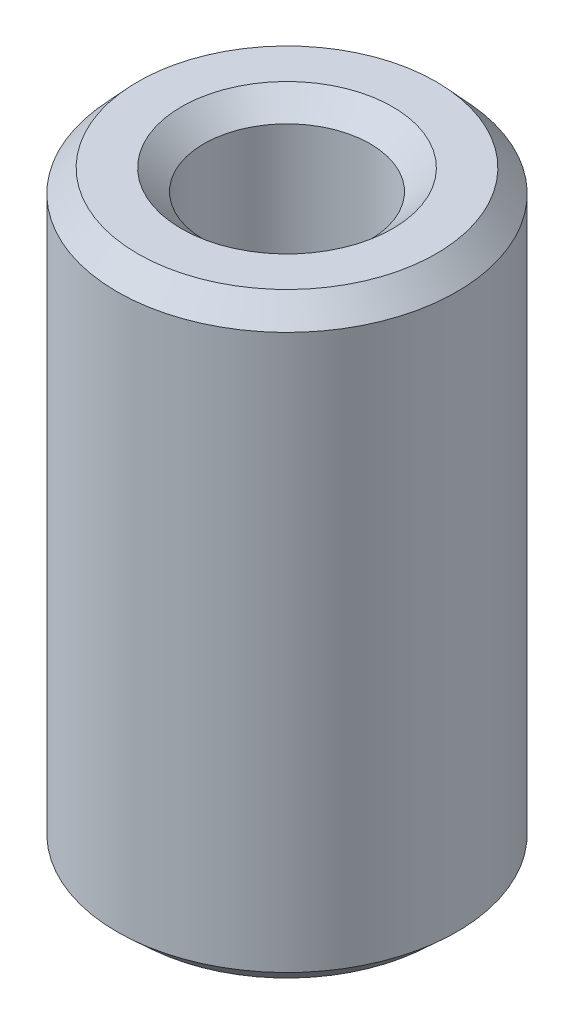
ISO-10303-21;
HEADER;
FILE_DESCRIPTION(('STEP AP214'),'2;1');
FILE_NAME('part.step','',(''),(''),'','','');
FILE_SCHEMA(('AUTOMOTIVE_DESIGN { 1 0 10303 214 1 1 1 1 }'));
ENDSEC;
DATA;
#1=APPLICATION_CONTEXT('core data for automotive mechanical design processes');
#2=APPLICATION_PROTOCOL_DEFINITION('international standard','automotive_design',2000,#1);
#3=PRODUCT_CONTEXT('',#1,'mechanical');
#4=PRODUCT('Part','Part','',(#3));
#5=PRODUCT_RELATED_PRODUCT_CATEGORY('part','',(#4));
#6=PRODUCT_DEFINITION_FORMATION('','',#4);
#7=PRODUCT_DEFINITION_CONTEXT('part definition',#1,'design');
#8=PRODUCT_DEFINITION('design','',#6,#7);
#9=PRODUCT_DEFINITION_SHAPE('','',#8);
#10=(LENGTH_UNIT() NAMED_UNIT(*) SI_UNIT(.MILLI.,.METRE.));
#11=(NAMED_UNIT(*) PLANE_ANGLE_UNIT() SI_UNIT($,.RADIAN.));
#12=(NAMED_UNIT(*) SI_UNIT($,.STERADIAN.) SOLID_ANGLE_UNIT());
#13=UNCERTAINTY_MEASURE_WITH_UNIT(LENGTH_MEASURE(1.E-05),#10,'distance_accuracy_value','');
#14=(GEOMETRIC_REPRESENTATION_CONTEXT(3) GLOBAL_UNCERTAINTY_ASSIGNED_CONTEXT((#13)) GLOBAL_UNIT_ASSIGNED_CONTEXT((#10,
#11,#12)) REPRESENTATION_CONTEXT('',''));
#15=CARTESIAN_POINT('',(0.,0.,0.));
#16=DIRECTION('',(0.,0.,1.));
#17=DIRECTION('',(1.,0.,0.));
#18=AXIS2_PLACEMENT_3D('',#15,#16,#17);
#19=CARTESIAN_POINT('',(0.,52.7762804716084,0.));
#20=DIRECTION('',(0.,-1.,0.));
#21=DIRECTION('',(0.,0.,-1.));
#22=AXIS2_PLACEMENT_3D('',#19,#20,#21);
#23=CYLINDRICAL_SURFACE('',#22,15.);
#24=CARTESIAN_POINT('',(0.,1.82945939377958,0.));
#25=DIRECTION('',(0.,1.,0.));
#26=DIRECTION('',(0.,0.,1.));
#27=AXIS2_PLACEMENT_3D('',#24,#25,#26);
#28=CIRCLE('',#27,15.);
#29=CARTESIAN_POINT('',(0.,1.82945939377957,-15.));
#30=VERTEX_POINT('',#29);
#31=EDGE_CURVE('E10',#30,#30,#28,.T.);
#32=CARTESIAN_POINT('',(0.,50.7862467697742,0.));
#33=DIRECTION('',(0.,1.,0.));
#34=DIRECTION('',(0.,0.,1.));
#35=AXIS2_PLACEMENT_3D('',#32,#33,#34);
#36=CIRCLE('',#35,15.);
#37=CARTESIAN_POINT('',(0.,50.7862467697742,-15.));
#38=VERTEX_POINT('',#37);
#39=EDGE_CURVE('E50',#38,#38,#36,.F.);
#40=CARTESIAN_POINT('',(0.,1.82945939377957,-15.));
#41=CARTESIAN_POINT('',(0.,2.33942592894618,-15.));
#42=CARTESIAN_POINT('',(0.,2.84939246411279,-15.));
#43=CARTESIAN_POINT('',(0.,3.86932553444601,-15.));
#44=CARTESIAN_POINT('',(0.,4.37929206961262,-15.));
#45=CARTESIAN_POINT('',(0.,5.39922513994584,-15.));
#46=CARTESIAN_POINT('',(0.,5.90919167511246,-15.));
#47=CARTESIAN_POINT('',(0.,6.92912474544568,-15.));
#48=CARTESIAN_POINT('',(0.,7.43909128061229,-15.));
#49=CARTESIAN_POINT('',(0.,8.45902435094551,-15.));
#50=CARTESIAN_POINT('',(0.,8.96899088611212,-15.));
#51=CARTESIAN_POINT('',(0.,9.98892395644534,-15.));
#52=CARTESIAN_POINT('',(0.,10.498890491612,-15.));
#53=CARTESIAN_POINT('',(0.,11.5188235619452,-15.));
#54=CARTESIAN_POINT('',(0.,12.0287900971118,-15.));
#55=CARTESIAN_POINT('',(0.,13.048723167445,-15.));
#56=CARTESIAN_POINT('',(0.,13.5586897026116,-15.));
#57=CARTESIAN_POINT('',(0.,14.5786227729448,-15.));
#58=CARTESIAN_POINT('',(0.,15.0885893081114,-15.));
#59=CARTESIAN_POINT('',(0.,16.1085223784447,-15.));
#60=CARTESIAN_POINT('',(0.,16.6184889136113,-15.));
#61=CARTESIAN_POINT('',(0.,17.6384219839445,-15.));
#62=CARTESIAN_POINT('',(0.,18.1483885191111,-15.));
#63=CARTESIAN_POINT('',(0.,19.1683215894443,-15.));
#64=CARTESIAN_POINT('',(0.,19.6782881246109,-15.));
#65=CARTESIAN_POINT('',(0.,20.6982211949442,-15.));
#66=CARTESIAN_POINT('',(0.,21.2081877301108,-15.));
#67=CARTESIAN_POINT('',(0.,22.228120800444,-15.));
#68=CARTESIAN_POINT('',(0.,22.7380873356106,-15.));
#69=CARTESIAN_POINT('',(0.,23.7580204059438,-15.));
#70=CARTESIAN_POINT('',(0.,24.2679869411104,-15.));
#71=CARTESIAN_POINT('',(0.,25.2879200114437,-15.));
#72=CARTESIAN_POINT('',(0.,25.7978865466103,-15.));
#73=CARTESIAN_POINT('',(0.,26.8178196169435,-15.));
#74=CARTESIAN_POINT('',(0.,27.3277861521101,-15.));
#75=CARTESIAN_POINT('',(0.,28.3477192224433,-15.));
#76=CARTESIAN_POINT('',(0.,28.8576857576099,-15.));
#77=CARTESIAN_POINT('',(0.,29.8776188279432,-15.));
#78=CARTESIAN_POINT('',(0.,30.3875853631098,-15.));
#79=CARTESIAN_POINT('',(0.,31.407518433443,-15.));
#80=CARTESIAN_POINT('',(0.,31.9174849686096,-15.));
#81=CARTESIAN_POINT('',(0.,32.9374180389428,-15.));
#82=CARTESIAN_POINT('',(0.,33.4473845741094,-15.));
#83=CARTESIAN_POINT('',(0.,34.4673176444427,-15.));
#84=CARTESIAN_POINT('',(0.,34.9772841796093,-15.));
#85=CARTESIAN_POINT('',(0.,35.9972172499425,-15.));
#86=CARTESIAN_POINT('',(0.,36.5071837851091,-15.));
#87=CARTESIAN_POINT('',(0.,37.5271168554423,-15.));
#88=CARTESIAN_POINT('',(0.,38.0370833906089,-15.));
#89=CARTESIAN_POINT('',(0.,39.0570164609421,-15.));
#90=CARTESIAN_POINT('',(0.,39.5669829961087,-15.));
#91=CARTESIAN_POINT('',(0.,40.586916066442,-15.));
#92=CARTESIAN_POINT('',(0.,41.0968826016086,-15.));
#93=CARTESIAN_POINT('',(0.,42.1168156719418,-15.));
#94=CARTESIAN_POINT('',(0.,42.6267822071084,-15.));
#95=CARTESIAN_POINT('',(0.,43.6467152774416,-15.));
#96=CARTESIAN_POINT('',(0.,44.1566818126082,-15.));
#97=CARTESIAN_POINT('',(0.,45.1766148829415,-15.));
#98=CARTESIAN_POINT('',(0.,45.6865814181081,-15.));
#99=CARTESIAN_POINT('',(0.,46.7065144884413,-15.));
#100=CARTESIAN_POINT('',(0.,47.2164810236079,-15.));
#101=CARTESIAN_POINT('',(0.,48.2364140939411,-15.));
#102=CARTESIAN_POINT('',(0.,48.7463806291077,-15.));
#103=CARTESIAN_POINT('',(0.,49.766313699441,-15.));
#104=CARTESIAN_POINT('',(0.,50.2762802346076,-15.));
#105=CARTESIAN_POINT('',(0.,50.7862467697742,-15.));
#106=B_SPLINE_CURVE_WITH_KNOTS('',3,(#40,#41,#42,#43,#44,#45,#46,#47,#48,#49,#50,#51,#52,#53,
#54,#55,#56,#57,#58,#59,#60,#61,#62,#63,#64,#65,#66,#67,#68,#69,#70,#71,#72,#73,#74,#75,#76,#77,
#78,#79,#80,#81,#82,#83,#84,#85,#86,#87,#88,#89,#90,#91,#92,#93,#94,#95,#96,#97,#98,#99,#100,
#101,#102,#103,#104,#105),.UNSPECIFIED.,.F.,.F.,(4,2,2,2,2,2,2,2,2,2,2,2,2,2,2,2,2,2,2,2,2,2,2,
2,2,2,2,2,2,2,2,2,4),(0.,1.52989960549983,3.05979921099966,4.5896988164995,6.11959842199933,
7.64949802749916,9.17939763299899,10.7092972384988,12.2391968439987,13.7690964494985,
15.2989960549983,16.8288956604982,18.358795265998,19.8886948714978,21.4185944769976,
22.9484940824975,24.4783936879973,26.0082932934971,27.538192898997,29.0680925044968,
30.5979921099966,32.1278917154965,33.6577913209963,35.1876909264961,36.717590531996,
38.2474901374958,39.7773897429956,41.3072893484955,42.8371889539953,44.3670885594951,
45.896988164995,47.4268877704948,48.9567873759946),.UNSPECIFIED.);
#107=EDGE_CURVE('BSEAM39',#30,#38,#106,.T.);
#108=ORIENTED_EDGE('',*,*,#31,.T.);
#109=ORIENTED_EDGE('',*,*,#39,.T.);
#110=ORIENTED_EDGE('',*,*,#107,.T.);
#111=ORIENTED_EDGE('',*,*,#107,.F.);
#112=EDGE_LOOP('',(#108,#110,#109,#111));
#113=FACE_BOUND('',#112,.T.);
#114=ADVANCED_FACE('F39',(#113),#23,.T.);
#115=CARTESIAN_POINT('',(0.,52.7762804716084,0.));
#116=DIRECTION('',(0.,1.,0.));
#117=DIRECTION('',(0.,0.,1.));
#118=AXIS2_PLACEMENT_3D('',#115,#116,#117);
#119=PLANE('',#118);
#120=CARTESIAN_POINT('',(0.,52.7762804716084,0.));
#121=DIRECTION('',(0.,1.,0.));
#122=DIRECTION('',(0.,0.,1.));
#123=AXIS2_PLACEMENT_3D('',#120,#121,#122);
#124=CIRCLE('',#123,9.32959776285785);
#125=CARTESIAN_POINT('',(0.,52.7762804716084,9.32959776285785));
#126=VERTEX_POINT('',#125);
#127=EDGE_CURVE('E58',#126,#126,#124,.F.);
#128=ORIENTED_EDGE('',*,*,#127,.T.);
#129=EDGE_LOOP('',(#128));
#130=FACE_BOUND('',#129,.T.);
#131=CARTESIAN_POINT('',(0.,52.7762804716084,0.));
#132=DIRECTION('',(0.,1.,0.));
#133=DIRECTION('',(0.,0.,1.));
#134=AXIS2_PLACEMENT_3D('',#131,#132,#133);
#135=CIRCLE('',#134,13.1705406062205);
#136=CARTESIAN_POINT('',(0.,52.7762804716084,13.1705406062205));
#137=VERTEX_POINT('',#136);
#138=EDGE_CURVE('E61',#137,#137,#135,.T.);
#139=ORIENTED_EDGE('',*,*,#138,.T.);
#140=EDGE_LOOP('',(#139));
#141=FACE_BOUND('',#140,.T.);
#142=ADVANCED_FACE('F88',(#130,#141),#119,.T.);
#143=CARTESIAN_POINT('',(0.,0.,0.));
#144=DIRECTION('',(0.,1.,0.));
#145=DIRECTION('',(0.,0.,1.));
#146=AXIS2_PLACEMENT_3D('',#143,#144,#145);
#147=PLANE('',#146);
#148=CARTESIAN_POINT('',(0.,0.,0.));
#149=DIRECTION('',(0.,1.,0.));
#150=DIRECTION('',(0.,0.,1.));
#151=AXIS2_PLACEMENT_3D('',#148,#149,#150);
#152=CIRCLE('',#151,9.16902345480308);
#153=CARTESIAN_POINT('',(0.,0.,9.16902345480308));
#154=VERTEX_POINT('',#153);
#155=EDGE_CURVE('E51',#154,#154,#152,.T.);
#156=ORIENTED_EDGE('',*,*,#155,.T.);
#157=EDGE_LOOP('',(#156));
#158=FACE_BOUND('',#157,.T.);
#159=CARTESIAN_POINT('',(0.,0.,0.));
#160=DIRECTION('',(0.,1.,0.));
#161=DIRECTION('',(0.,0.,1.));
#162=AXIS2_PLACEMENT_3D('',#159,#160,#161);
#163=CIRCLE('',#162,13.0099662981657);
#164=CARTESIAN_POINT('',(0.,0.,13.0099662981657));
#165=VERTEX_POINT('',#164);
#166=EDGE_CURVE('E54',#165,#165,#163,.F.);
#167=ORIENTED_EDGE('',*,*,#166,.T.);
#168=EDGE_LOOP('',(#167));
#169=FACE_BOUND('',#168,.T.);
#170=ADVANCED_FACE('F83',(#158,#169),#147,.F.);
#171=CARTESIAN_POINT('',(0.,52.7762804716084,0.));
#172=DIRECTION('',(0.,-1.,0.));
#173=DIRECTION('',(0.,0.,-1.));
#174=AXIS2_PLACEMENT_3D('',#171,#172,#173);
#175=CYLINDRICAL_SURFACE('',#174,7.33956406102357);
#176=CARTESIAN_POINT('',(0.,50.9468210778288,0.));
#177=DIRECTION('',(0.,1.,0.));
#178=DIRECTION('',(0.,0.,1.));
#179=AXIS2_PLACEMENT_3D('',#176,#177,#178);
#180=CIRCLE('',#179,7.33956406102357);
#181=CARTESIAN_POINT('',(0.,50.9468210778288,-7.33956406102357));
#182=VERTEX_POINT('',#181);
#183=EDGE_CURVE('E67',#182,#182,#180,.T.);
#184=CARTESIAN_POINT('',(0.,1.99003370183423,0.));
#185=DIRECTION('',(0.,1.,0.));
#186=DIRECTION('',(0.,0.,1.));
#187=AXIS2_PLACEMENT_3D('',#184,#185,#186);
#188=CIRCLE('',#187,7.33956406102357);
#189=CARTESIAN_POINT('',(0.,1.99003370183423,-7.33956406102357));
#190=VERTEX_POINT('',#189);
#191=EDGE_CURVE('E69',#190,#190,#188,.F.);
#192=CARTESIAN_POINT('',(0.,50.9468210778288,-7.33956406102357));
#193=CARTESIAN_POINT('',(0.,50.4368545426622,-7.33956406102357));
#194=CARTESIAN_POINT('',(0.,49.9268880074956,-7.33956406102357));
#195=CARTESIAN_POINT('',(0.,48.9069549371624,-7.33956406102357));
#196=CARTESIAN_POINT('',(0.,48.3969884019958,-7.33956406102357));
#197=CARTESIAN_POINT('',(0.,47.3770553316625,-7.33956406102357));
#198=CARTESIAN_POINT('',(0.,46.8670887964959,-7.33956406102357));
#199=CARTESIAN_POINT('',(0.,45.8471557261627,-7.33956406102357));
#200=CARTESIAN_POINT('',(0.,45.3371891909961,-7.33956406102357));
#201=CARTESIAN_POINT('',(0.,44.3172561206629,-7.33956406102357));
#202=CARTESIAN_POINT('',(0.,43.8072895854963,-7.33956406102357));
#203=CARTESIAN_POINT('',(0.,42.787356515163,-7.33956406102357));
#204=CARTESIAN_POINT('',(0.,42.2773899799964,-7.33956406102357));
#205=CARTESIAN_POINT('',(0.,41.2574569096632,-7.33956406102357));
#206=CARTESIAN_POINT('',(0.,40.7474903744966,-7.33956406102357));
#207=CARTESIAN_POINT('',(0.,39.7275573041634,-7.33956406102357));
#208=CARTESIAN_POINT('',(0.,39.2175907689968,-7.33956406102357));
#209=CARTESIAN_POINT('',(0.,38.1976576986635,-7.33956406102357));
#210=CARTESIAN_POINT('',(0.,37.6876911634969,-7.33956406102357));
#211=CARTESIAN_POINT('',(0.,36.6677580931637,-7.33956406102357));
#212=CARTESIAN_POINT('',(0.,36.1577915579971,-7.33956406102357));
#213=CARTESIAN_POINT('',(0.,35.1378584876639,-7.33956406102357));
#214=CARTESIAN_POINT('',(0.,34.6278919524973,-7.33956406102357));
#215=CARTESIAN_POINT('',(0.,33.6079588821641,-7.33956406102357));
#216=CARTESIAN_POINT('',(0.,33.0979923469975,-7.33956406102357));
#217=CARTESIAN_POINT('',(0.,32.0780592766642,-7.33956406102357));
#218=CARTESIAN_POINT('',(0.,31.5680927414976,-7.33956406102357));
#219=CARTESIAN_POINT('',(0.,30.5481596711644,-7.33956406102357));
#220=CARTESIAN_POINT('',(0.,30.0381931359978,-7.33956406102357));
#221=CARTESIAN_POINT('',(0.,29.0182600656646,-7.33956406102357));
#222=CARTESIAN_POINT('',(0.,28.508293530498,-7.33956406102357));
#223=CARTESIAN_POINT('',(0.,27.4883604601647,-7.33956406102357));
#224=CARTESIAN_POINT('',(0.,26.9783939249981,-7.33956406102357));
#225=CARTESIAN_POINT('',(0.,25.9584608546649,-7.33956406102357));
#226=CARTESIAN_POINT('',(0.,25.4484943194983,-7.33956406102357));
#227=CARTESIAN_POINT('',(0.,24.4285612491651,-7.33956406102357));
#228=CARTESIAN_POINT('',(0.,23.9185947139985,-7.33956406102357));
#229=CARTESIAN_POINT('',(0.,22.8986616436652,-7.33956406102357));
#230=CARTESIAN_POINT('',(0.,22.3886951084986,-7.33956406102357));
#231=CARTESIAN_POINT('',(0.,21.3687620381654,-7.33956406102357));
#232=CARTESIAN_POINT('',(0.,20.8587955029988,-7.33956406102357));
#233=CARTESIAN_POINT('',(0.,19.8388624326656,-7.33956406102357));
#234=CARTESIAN_POINT('',(0.,19.328895897499,-7.33956406102357));
#235=CARTESIAN_POINT('',(0.,18.3089628271658,-7.33956406102357));
#236=CARTESIAN_POINT('',(0.,17.7989962919991,-7.33956406102357));
#237=CARTESIAN_POINT('',(0.,16.7790632216659,-7.33956406102357));
#238=CARTESIAN_POINT('',(0.,16.2690966864993,-7.33956406102357));
#239=CARTESIAN_POINT('',(0.,15.2491636161661,-7.33956406102357));
#240=CARTESIAN_POINT('',(0.,14.7391970809995,-7.33956406102357));
#241=CARTESIAN_POINT('',(0.,13.7192640106663,-7.33956406102357));
#242=CARTESIAN_POINT('',(0.,13.2092974754997,-7.33956406102357));
#243=CARTESIAN_POINT('',(0.,12.1893644051664,-7.33956406102357));
#244=CARTESIAN_POINT('',(0.,11.6793978699998,-7.33956406102357));
#245=CARTESIAN_POINT('',(0.,10.6594647996666,-7.33956406102357));
#246=CARTESIAN_POINT('',(0.,10.1494982645,-7.33956406102357));
#247=CARTESIAN_POINT('',(0.,9.12956519416677,-7.33956406102357));
#248=CARTESIAN_POINT('',(0.,8.61959865900016,-7.33956406102357));
#249=CARTESIAN_POINT('',(0.,7.59966558866694,-7.33956406102357));
#250=CARTESIAN_POINT('',(0.,7.08969905350032,-7.33956406102357));
#251=CARTESIAN_POINT('',(0.,6.06976598316711,-7.33956406102357));
#252=CARTESIAN_POINT('',(0.,5.5597994480005,-7.33956406102357));
#253=CARTESIAN_POINT('',(0.,4.53986637766729,-7.33956406102357));
#254=CARTESIAN_POINT('',(0.,4.02989984250067,-7.33956406102357));
#255=CARTESIAN_POINT('',(0.,3.00996677216745,-7.33956406102357));
#256=CARTESIAN_POINT('',(0.,2.50000023700084,-7.33956406102357));
#257=CARTESIAN_POINT('',(0.,1.99003370183423,-7.33956406102357));
#258=B_SPLINE_CURVE_WITH_KNOTS('',3,(#192,#193,#194,#195,#196,#197,#198,#199,#200,#201,#202,
#203,#204,#205,#206,#207,#208,#209,#210,#211,#212,#213,#214,#215,#216,#217,#218,#219,#220,#221,
#222,#223,#224,#225,#226,#227,#228,#229,#230,#231,#232,#233,#234,#235,#236,#237,#238,#239,#240,
#241,#242,#243,#244,#245,#246,#247,#248,#249,#250,#251,#252,#253,#254,#255,#256,#257),
.UNSPECIFIED.,.F.,.F.,(4,2,2,2,2,2,2,2,2,2,2,2,2,2,2,2,2,2,2,2,2,2,2,2,2,2,2,2,2,2,2,2,4),(0.,
1.52989960549983,3.05979921099966,4.5896988164995,6.11959842199932,7.64949802749915,
9.17939763299898,10.7092972384988,12.2391968439987,13.7690964494985,15.2989960549983,
16.8288956604981,18.358795265998,19.8886948714978,21.4185944769976,22.9484940824975,
24.4783936879973,26.0082932934971,27.538192898997,29.0680925044968,30.5979921099966,
32.1278917154964,33.6577913209963,35.1876909264961,36.7175905319959,38.2474901374958,
39.7773897429956,41.3072893484954,42.8371889539953,44.3670885594951,45.8969881649949,
47.4268877704947,48.9567873759946),.UNSPECIFIED.);
#259=EDGE_CURVE('BSEAM71',#182,#190,#258,.T.);
#260=ORIENTED_EDGE('',*,*,#183,.T.);
#261=ORIENTED_EDGE('',*,*,#191,.T.);
#262=ORIENTED_EDGE('',*,*,#259,.T.);
#263=ORIENTED_EDGE('',*,*,#259,.F.);
#264=EDGE_LOOP('',(#260,#262,#261,#263));
#265=FACE_BOUND('',#264,.T.);
#266=ADVANCED_FACE('F71',(#265),#175,.F.);
#267=CARTESIAN_POINT('',(0.,50.9468210778288,0.));
#268=DIRECTION('',(0.,1.,0.));
#269=DIRECTION('',(0.,0.,1.));
#270=AXIS2_PLACEMENT_3D('',#267,#268,#269);
#271=CONICAL_SURFACE('',#270,7.33956406102357,0.82741415957499);
#272=ORIENTED_EDGE('',*,*,#127,.F.);
#273=EDGE_LOOP('',(#272));
#274=FACE_BOUND('',#273,.T.);
#275=ORIENTED_EDGE('',*,*,#183,.F.);
#276=EDGE_LOOP('',(#275));
#277=FACE_BOUND('',#276,.T.);
#278=ADVANCED_FACE('F77',(#274,#277),#271,.F.);
#279=CARTESIAN_POINT('',(0.,0.,0.));
#280=DIRECTION('',(0.,-1.,0.));
#281=DIRECTION('',(0.,0.,-1.));
#282=AXIS2_PLACEMENT_3D('',#279,#280,#281);
#283=CONICAL_SURFACE('',#282,9.16902345480308,0.743382167219904);
#284=ORIENTED_EDGE('',*,*,#191,.F.);
#285=EDGE_LOOP('',(#284));
#286=FACE_BOUND('',#285,.T.);
#287=ORIENTED_EDGE('',*,*,#155,.F.);
#288=EDGE_LOOP('',(#287));
#289=FACE_BOUND('',#288,.T.);
#290=ADVANCED_FACE('F73',(#286,#289),#283,.F.);
#291=CARTESIAN_POINT('',(0.,1.82945939377958,0.));
#292=DIRECTION('',(0.,1.,0.));
#293=DIRECTION('',(0.,0.,1.));
#294=AXIS2_PLACEMENT_3D('',#291,#292,#293);
#295=CONICAL_SURFACE('',#294,15.,0.82741415957499);
#296=ORIENTED_EDGE('',*,*,#166,.F.);
#297=EDGE_LOOP('',(#296));
#298=FACE_BOUND('',#297,.T.);
#299=ORIENTED_EDGE('',*,*,#31,.F.);
#300=EDGE_LOOP('',(#299));
#301=FACE_BOUND('',#300,.T.);
#302=ADVANCED_FACE('F76',(#298,#301),#295,.T.);
#303=CARTESIAN_POINT('',(0.,52.7762804716084,0.));
#304=DIRECTION('',(0.,-1.,0.));
#305=DIRECTION('',(0.,0.,-1.));
#306=AXIS2_PLACEMENT_3D('',#303,#304,#305);
#307=CONICAL_SURFACE('',#306,13.1705406062205,0.743382167219909);
#308=ORIENTED_EDGE('',*,*,#39,.F.);
#309=EDGE_LOOP('',(#308));
#310=FACE_BOUND('',#309,.T.);
#311=ORIENTED_EDGE('',*,*,#138,.F.);
#312=EDGE_LOOP('',(#311));
#313=FACE_BOUND('',#312,.T.);
#314=ADVANCED_FACE('F45',(#310,#313),#307,.T.);
#315=CLOSED_SHELL('',(#114,#142,#170,#266,#278,#290,#302,#314));
#316=MANIFOLD_SOLID_BREP('B2',#315);
#317=ADVANCED_BREP_SHAPE_REPRESENTATION('',(#18,#316),#14);
#318=SHAPE_DEFINITION_REPRESENTATION(#9,#317);
ENDSEC;
END-ISO-10303-21;
